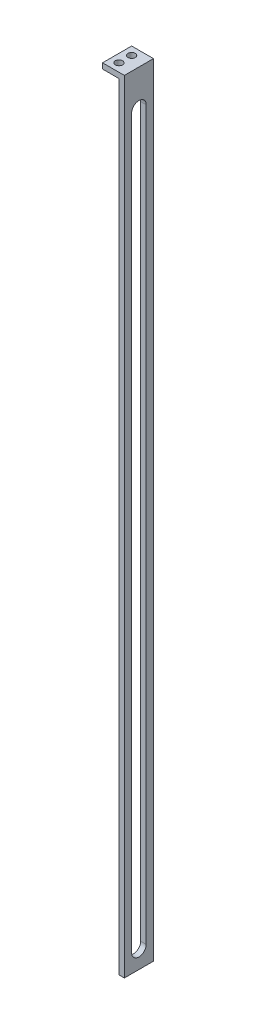
ISO-10303-21;
HEADER;
FILE_DESCRIPTION(('STEP AP214'),'2;1');
FILE_NAME('part.step','',(''),(''),'','','');
FILE_SCHEMA(('AUTOMOTIVE_DESIGN { 1 0 10303 214 1 1 1 1 }'));
ENDSEC;
DATA;
#1=APPLICATION_CONTEXT('core data for automotive mechanical design processes');
#2=APPLICATION_PROTOCOL_DEFINITION('international standard','automotive_design',2000,#1);
#3=PRODUCT_CONTEXT('',#1,'mechanical');
#4=PRODUCT('Part','Part','',(#3));
#5=PRODUCT_RELATED_PRODUCT_CATEGORY('part','',(#4));
#6=PRODUCT_DEFINITION_FORMATION('','',#4);
#7=PRODUCT_DEFINITION_CONTEXT('part definition',#1,'design');
#8=PRODUCT_DEFINITION('design','',#6,#7);
#9=PRODUCT_DEFINITION_SHAPE('','',#8);
#10=(LENGTH_UNIT() NAMED_UNIT(*) SI_UNIT(.MILLI.,.METRE.));
#11=(NAMED_UNIT(*) PLANE_ANGLE_UNIT() SI_UNIT($,.RADIAN.));
#12=(NAMED_UNIT(*) SI_UNIT($,.STERADIAN.) SOLID_ANGLE_UNIT());
#13=UNCERTAINTY_MEASURE_WITH_UNIT(LENGTH_MEASURE(1.E-05),#10,'distance_accuracy_value','');
#14=(GEOMETRIC_REPRESENTATION_CONTEXT(3) GLOBAL_UNCERTAINTY_ASSIGNED_CONTEXT((#13)) GLOBAL_UNIT_ASSIGNED_CONTEXT((#10,
#11,#12)) REPRESENTATION_CONTEXT('',''));
#15=CARTESIAN_POINT('',(0.,0.,0.));
#16=DIRECTION('',(0.,0.,1.));
#17=DIRECTION('',(1.,0.,0.));
#18=AXIS2_PLACEMENT_3D('',#15,#16,#17);
#19=CARTESIAN_POINT('',(-96.6666666666667,106.166666666667,16.));
#20=DIRECTION('',(1.,0.,0.));
#21=DIRECTION('',(0.,0.,-1.));
#22=AXIS2_PLACEMENT_3D('',#19,#20,#21);
#23=PLANE('',#22);
#24=DIRECTION('',(0.,-1.,0.));
#25=VECTOR('',#24,1.);
#26=CARTESIAN_POINT('',(-96.6666666666667,106.166666666667,0.));
#27=LINE('',#26,#25);
#28=CARTESIAN_POINT('',(-96.6666666666667,109.166666666667,0.));
#29=VERTEX_POINT('',#28);
#30=CARTESIAN_POINT('',(-96.6666666666667,106.166666666667,0.));
#31=VERTEX_POINT('',#30);
#32=EDGE_CURVE('E142',#29,#31,#27,.T.);
#33=ORIENTED_EDGE('',*,*,#32,.T.);
#34=DIRECTION('',(0.,0.,-1.));
#35=VECTOR('',#34,1.);
#36=CARTESIAN_POINT('',(-96.6666666666667,106.166666666667,16.));
#37=LINE('',#36,#35);
#38=CARTESIAN_POINT('',(-96.6666666666667,106.166666666667,16.));
#39=VERTEX_POINT('',#38);
#40=EDGE_CURVE('E183',#39,#31,#37,.T.);
#41=ORIENTED_EDGE('',*,*,#40,.F.);
#42=DIRECTION('',(0.,-1.,0.));
#43=VECTOR('',#42,1.);
#44=CARTESIAN_POINT('',(-96.6666666666667,106.166666666667,16.));
#45=LINE('',#44,#43);
#46=CARTESIAN_POINT('',(-96.6666666666667,109.166666666667,16.));
#47=VERTEX_POINT('',#46);
#48=EDGE_CURVE('E143',#47,#39,#45,.T.);
#49=ORIENTED_EDGE('',*,*,#48,.F.);
#50=DIRECTION('',(0.,0.,-1.));
#51=VECTOR('',#50,1.);
#52=CARTESIAN_POINT('',(-96.6666666666667,109.166666666667,16.));
#53=LINE('',#52,#51);
#54=EDGE_CURVE('E157',#47,#29,#53,.T.);
#55=ORIENTED_EDGE('',*,*,#54,.T.);
#56=EDGE_LOOP('',(#33,#41,#49,#55));
#57=FACE_BOUND('',#56,.T.);
#58=ADVANCED_FACE('F34',(#57),#23,.F.);
#59=CARTESIAN_POINT('',(-87.6666666666667,106.166666666667,16.));
#60=DIRECTION('',(0.,1.,0.));
#61=DIRECTION('',(-1.,0.,0.));
#62=AXIS2_PLACEMENT_3D('',#59,#60,#61);
#63=PLANE('',#62);
#64=CARTESIAN_POINT('',(-92.1666666666667,106.166666666667,11.5));
#65=DIRECTION('',(0.,1.,0.));
#66=DIRECTION('',(-1.,0.,0.));
#67=AXIS2_PLACEMENT_3D('',#64,#65,#66);
#68=CIRCLE('',#67,2.);
#69=CARTESIAN_POINT('',(-94.1666666666667,106.166666666667,11.5));
#70=VERTEX_POINT('',#69);
#71=EDGE_CURVE('E139',#70,#70,#68,.T.);
#72=ORIENTED_EDGE('',*,*,#71,.T.);
#73=EDGE_LOOP('',(#72));
#74=FACE_BOUND('',#73,.T.);
#75=CARTESIAN_POINT('',(-92.1666666666667,106.166666666667,4.5));
#76=DIRECTION('',(0.,1.,0.));
#77=DIRECTION('',(-1.,0.,0.));
#78=AXIS2_PLACEMENT_3D('',#75,#76,#77);
#79=CIRCLE('',#78,2.);
#80=CARTESIAN_POINT('',(-94.1666666666667,106.166666666667,4.5));
#81=VERTEX_POINT('',#80);
#82=EDGE_CURVE('E135',#81,#81,#79,.T.);
#83=ORIENTED_EDGE('',*,*,#82,.T.);
#84=EDGE_LOOP('',(#83));
#85=FACE_BOUND('',#84,.T.);
#86=DIRECTION('',(1.,0.,0.));
#87=VECTOR('',#86,1.);
#88=CARTESIAN_POINT('',(-87.6666666666667,106.166666666667,0.));
#89=LINE('',#88,#87);
#90=CARTESIAN_POINT('',(-87.6666666666667,106.166666666667,0.));
#91=VERTEX_POINT('',#90);
#92=EDGE_CURVE('E160',#31,#91,#89,.T.);
#93=ORIENTED_EDGE('',*,*,#92,.T.);
#94=DIRECTION('',(0.,0.,-1.));
#95=VECTOR('',#94,1.);
#96=CARTESIAN_POINT('',(-87.6666666666667,106.166666666667,16.));
#97=LINE('',#96,#95);
#98=CARTESIAN_POINT('',(-87.6666666666667,106.166666666667,16.));
#99=VERTEX_POINT('',#98);
#100=EDGE_CURVE('E180',#99,#91,#97,.T.);
#101=ORIENTED_EDGE('',*,*,#100,.F.);
#102=DIRECTION('',(1.,0.,0.));
#103=VECTOR('',#102,1.);
#104=CARTESIAN_POINT('',(-87.6666666666667,106.166666666667,16.));
#105=LINE('',#104,#103);
#106=EDGE_CURVE('E146',#39,#99,#105,.T.);
#107=ORIENTED_EDGE('',*,*,#106,.F.);
#108=ORIENTED_EDGE('',*,*,#40,.T.);
#109=EDGE_LOOP('',(#93,#101,#107,#108));
#110=FACE_BOUND('',#109,.T.);
#111=ADVANCED_FACE('F213',(#74,#85,#110),#63,.F.);
#112=CARTESIAN_POINT('',(-87.6666666666667,-320.833333333333,16.));
#113=DIRECTION('',(1.,0.,0.));
#114=DIRECTION('',(0.,1.,0.));
#115=AXIS2_PLACEMENT_3D('',#112,#113,#114);
#116=PLANE('',#115);
#117=DIRECTION('',(0.,1.,0.));
#118=VECTOR('',#117,1.);
#119=CARTESIAN_POINT('',(-87.6666666666667,-320.833333333333,3.99999999999995));
#120=LINE('',#119,#118);
#121=CARTESIAN_POINT('',(-87.6666666666667,-310.833333333333,3.99999999999995));
#122=VERTEX_POINT('',#121);
#123=CARTESIAN_POINT('',(-87.6666666666667,89.1666666666667,4.));
#124=VERTEX_POINT('',#123);
#125=EDGE_CURVE('E125',#122,#124,#120,.T.);
#126=ORIENTED_EDGE('',*,*,#125,.T.);
#127=CARTESIAN_POINT('',(-87.6666666666667,89.1666666666667,8.));
#128=DIRECTION('',(1.,0.,0.));
#129=DIRECTION('',(0.,1.,0.));
#130=AXIS2_PLACEMENT_3D('',#127,#128,#129);
#131=CIRCLE('',#130,4.);
#132=CARTESIAN_POINT('',(-87.6666666666667,89.1666666666667,12.));
#133=VERTEX_POINT('',#132);
#134=EDGE_CURVE('E118',#124,#133,#131,.T.);
#135=ORIENTED_EDGE('',*,*,#134,.T.);
#136=DIRECTION('',(0.,-1.,0.));
#137=VECTOR('',#136,1.);
#138=CARTESIAN_POINT('',(-87.6666666666667,-320.833333333333,12.));
#139=LINE('',#138,#137);
#140=CARTESIAN_POINT('',(-87.6666666666667,-310.833333333333,12.));
#141=VERTEX_POINT('',#140);
#142=EDGE_CURVE('E107',#133,#141,#139,.T.);
#143=ORIENTED_EDGE('',*,*,#142,.T.);
#144=CARTESIAN_POINT('',(-87.6666666666667,-310.833333333333,7.99999999999995));
#145=DIRECTION('',(1.,0.,0.));
#146=DIRECTION('',(0.,1.,0.));
#147=AXIS2_PLACEMENT_3D('',#144,#145,#146);
#148=CIRCLE('',#147,4.);
#149=EDGE_CURVE('E112',#141,#122,#148,.T.);
#150=ORIENTED_EDGE('',*,*,#149,.T.);
#151=EDGE_LOOP('',(#126,#135,#143,#150));
#152=FACE_BOUND('',#151,.T.);
#153=DIRECTION('',(0.,-1.,0.));
#154=VECTOR('',#153,1.);
#155=CARTESIAN_POINT('',(-87.6666666666667,-320.833333333333,0.));
#156=LINE('',#155,#154);
#157=CARTESIAN_POINT('',(-87.6666666666667,-320.833333333333,0.));
#158=VERTEX_POINT('',#157);
#159=EDGE_CURVE('E162',#91,#158,#156,.T.);
#160=ORIENTED_EDGE('',*,*,#159,.T.);
#161=DIRECTION('',(0.,0.,-1.));
#162=VECTOR('',#161,1.);
#163=CARTESIAN_POINT('',(-87.6666666666667,-320.833333333333,16.));
#164=LINE('',#163,#162);
#165=CARTESIAN_POINT('',(-87.6666666666667,-320.833333333333,16.));
#166=VERTEX_POINT('',#165);
#167=EDGE_CURVE('E177',#166,#158,#164,.T.);
#168=ORIENTED_EDGE('',*,*,#167,.F.);
#169=DIRECTION('',(0.,-1.,0.));
#170=VECTOR('',#169,1.);
#171=CARTESIAN_POINT('',(-87.6666666666667,-320.833333333333,16.));
#172=LINE('',#171,#170);
#173=EDGE_CURVE('E149',#99,#166,#172,.T.);
#174=ORIENTED_EDGE('',*,*,#173,.F.);
#175=ORIENTED_EDGE('',*,*,#100,.T.);
#176=EDGE_LOOP('',(#160,#168,#174,#175));
#177=FACE_BOUND('',#176,.T.);
#178=ADVANCED_FACE('F123',(#152,#177),#116,.F.);
#179=CARTESIAN_POINT('',(-84.6666666666666,-320.833333333333,16.));
#180=DIRECTION('',(0.,1.,0.));
#181=DIRECTION('',(0.,0.,1.));
#182=AXIS2_PLACEMENT_3D('',#179,#180,#181);
#183=PLANE('',#182);
#184=DIRECTION('',(1.,0.,0.));
#185=VECTOR('',#184,1.);
#186=CARTESIAN_POINT('',(-84.6666666666666,-320.833333333333,0.));
#187=LINE('',#186,#185);
#188=CARTESIAN_POINT('',(-84.6666666666666,-320.833333333333,0.));
#189=VERTEX_POINT('',#188);
#190=EDGE_CURVE('E164',#158,#189,#187,.T.);
#191=ORIENTED_EDGE('',*,*,#190,.T.);
#192=DIRECTION('',(0.,0.,-1.));
#193=VECTOR('',#192,1.);
#194=CARTESIAN_POINT('',(-84.6666666666666,-320.833333333333,16.));
#195=LINE('',#194,#193);
#196=CARTESIAN_POINT('',(-84.6666666666666,-320.833333333333,16.));
#197=VERTEX_POINT('',#196);
#198=EDGE_CURVE('E174',#197,#189,#195,.T.);
#199=ORIENTED_EDGE('',*,*,#198,.F.);
#200=DIRECTION('',(1.,0.,0.));
#201=VECTOR('',#200,1.);
#202=CARTESIAN_POINT('',(-84.6666666666666,-320.833333333333,16.));
#203=LINE('',#202,#201);
#204=EDGE_CURVE('E151',#166,#197,#203,.T.);
#205=ORIENTED_EDGE('',*,*,#204,.F.);
#206=ORIENTED_EDGE('',*,*,#167,.T.);
#207=EDGE_LOOP('',(#191,#199,#205,#206));
#208=FACE_BOUND('',#207,.T.);
#209=ADVANCED_FACE('F241',(#208),#183,.F.);
#210=CARTESIAN_POINT('',(-84.6666666666667,109.166666666667,16.));
#211=DIRECTION('',(-1.,0.,0.));
#212=DIRECTION('',(0.,-1.,0.));
#213=AXIS2_PLACEMENT_3D('',#210,#211,#212);
#214=PLANE('',#213);
#215=DIRECTION('',(0.,1.,0.));
#216=VECTOR('',#215,1.);
#217=CARTESIAN_POINT('',(-84.6666666666667,109.166666666667,12.));
#218=LINE('',#217,#216);
#219=CARTESIAN_POINT('',(-84.6666666666667,-310.833333333333,12.));
#220=VERTEX_POINT('',#219);
#221=CARTESIAN_POINT('',(-84.6666666666667,89.1666666666667,12.));
#222=VERTEX_POINT('',#221);
#223=EDGE_CURVE('E186',#220,#222,#218,.T.);
#224=ORIENTED_EDGE('',*,*,#223,.T.);
#225=CARTESIAN_POINT('',(-84.6666666666667,89.1666666666667,8.));
#226=DIRECTION('',(-1.,0.,0.));
#227=DIRECTION('',(0.,-1.,0.));
#228=AXIS2_PLACEMENT_3D('',#225,#226,#227);
#229=CIRCLE('',#228,4.);
#230=CARTESIAN_POINT('',(-84.6666666666667,89.1666666666667,4.));
#231=VERTEX_POINT('',#230);
#232=EDGE_CURVE('E11',#222,#231,#229,.T.);
#233=ORIENTED_EDGE('',*,*,#232,.T.);
#234=DIRECTION('',(0.,-1.,0.));
#235=VECTOR('',#234,1.);
#236=CARTESIAN_POINT('',(-84.6666666666667,109.166666666667,4.));
#237=LINE('',#236,#235);
#238=CARTESIAN_POINT('',(-84.6666666666666,-310.833333333333,3.99999999999995));
#239=VERTEX_POINT('',#238);
#240=EDGE_CURVE('E41',#231,#239,#237,.T.);
#241=ORIENTED_EDGE('',*,*,#240,.T.);
#242=CARTESIAN_POINT('',(-84.6666666666666,-310.833333333333,7.99999999999995));
#243=DIRECTION('',(-1.,0.,0.));
#244=DIRECTION('',(0.,-1.,0.));
#245=AXIS2_PLACEMENT_3D('',#242,#243,#244);
#246=CIRCLE('',#245,4.);
#247=EDGE_CURVE('E188',#239,#220,#246,.T.);
#248=ORIENTED_EDGE('',*,*,#247,.T.);
#249=EDGE_LOOP('',(#224,#233,#241,#248));
#250=FACE_BOUND('',#249,.T.);
#251=DIRECTION('',(0.,1.,0.));
#252=VECTOR('',#251,1.);
#253=CARTESIAN_POINT('',(-84.6666666666667,109.166666666667,0.));
#254=LINE('',#253,#252);
#255=CARTESIAN_POINT('',(-84.6666666666667,109.166666666667,0.));
#256=VERTEX_POINT('',#255);
#257=EDGE_CURVE('E166',#189,#256,#254,.T.);
#258=ORIENTED_EDGE('',*,*,#257,.T.);
#259=DIRECTION('',(0.,0.,-1.));
#260=VECTOR('',#259,1.);
#261=CARTESIAN_POINT('',(-84.6666666666667,109.166666666667,16.));
#262=LINE('',#261,#260);
#263=CARTESIAN_POINT('',(-84.6666666666667,109.166666666667,16.));
#264=VERTEX_POINT('',#263);
#265=EDGE_CURVE('E171',#264,#256,#262,.T.);
#266=ORIENTED_EDGE('',*,*,#265,.F.);
#267=DIRECTION('',(0.,1.,0.));
#268=VECTOR('',#267,1.);
#269=CARTESIAN_POINT('',(-84.6666666666667,109.166666666667,16.));
#270=LINE('',#269,#268);
#271=EDGE_CURVE('E153',#197,#264,#270,.T.);
#272=ORIENTED_EDGE('',*,*,#271,.F.);
#273=ORIENTED_EDGE('',*,*,#198,.T.);
#274=EDGE_LOOP('',(#258,#266,#272,#273));
#275=FACE_BOUND('',#274,.T.);
#276=ADVANCED_FACE('F192',(#250,#275),#214,.F.);
#277=CARTESIAN_POINT('',(-96.6666666666667,109.166666666667,16.));
#278=DIRECTION('',(0.,-1.,0.));
#279=DIRECTION('',(0.,0.,-1.));
#280=AXIS2_PLACEMENT_3D('',#277,#278,#279);
#281=PLANE('',#280);
#282=CARTESIAN_POINT('',(-92.1666666666667,109.166666666667,11.5));
#283=DIRECTION('',(0.,1.,0.));
#284=DIRECTION('',(0.,0.,1.));
#285=AXIS2_PLACEMENT_3D('',#282,#283,#284);
#286=CIRCLE('',#285,2.);
#287=CARTESIAN_POINT('',(-92.1666666666667,109.166666666667,13.5));
#288=VERTEX_POINT('',#287);
#289=EDGE_CURVE('E129',#288,#288,#286,.T.);
#290=ORIENTED_EDGE('',*,*,#289,.F.);
#291=EDGE_LOOP('',(#290));
#292=FACE_BOUND('',#291,.T.);
#293=CARTESIAN_POINT('',(-92.1666666666667,109.166666666667,4.5));
#294=DIRECTION('',(0.,1.,0.));
#295=DIRECTION('',(0.,0.,-1.));
#296=AXIS2_PLACEMENT_3D('',#293,#294,#295);
#297=CIRCLE('',#296,2.);
#298=CARTESIAN_POINT('',(-92.1666666666667,109.166666666667,2.50000000000001));
#299=VERTEX_POINT('',#298);
#300=EDGE_CURVE('E126',#299,#299,#297,.T.);
#301=ORIENTED_EDGE('',*,*,#300,.F.);
#302=EDGE_LOOP('',(#301));
#303=FACE_BOUND('',#302,.T.);
#304=DIRECTION('',(-1.,0.,0.));
#305=VECTOR('',#304,1.);
#306=CARTESIAN_POINT('',(-96.6666666666667,109.166666666667,0.));
#307=LINE('',#306,#305);
#308=EDGE_CURVE('E147',#256,#29,#307,.T.);
#309=ORIENTED_EDGE('',*,*,#308,.T.);
#310=ORIENTED_EDGE('',*,*,#54,.F.);
#311=DIRECTION('',(-1.,0.,0.));
#312=VECTOR('',#311,1.);
#313=CARTESIAN_POINT('',(-96.6666666666667,109.166666666667,16.));
#314=LINE('',#313,#312);
#315=EDGE_CURVE('E155',#264,#47,#314,.T.);
#316=ORIENTED_EDGE('',*,*,#315,.F.);
#317=ORIENTED_EDGE('',*,*,#265,.T.);
#318=EDGE_LOOP('',(#309,#310,#316,#317));
#319=FACE_BOUND('',#318,.T.);
#320=ADVANCED_FACE('F238',(#292,#303,#319),#281,.F.);
#321=CARTESIAN_POINT('',(0.,0.,16.));
#322=DIRECTION('',(0.,0.,-1.));
#323=DIRECTION('',(-1.,0.,0.));
#324=AXIS2_PLACEMENT_3D('',#321,#322,#323);
#325=PLANE('',#324);
#326=ORIENTED_EDGE('',*,*,#48,.T.);
#327=ORIENTED_EDGE('',*,*,#106,.T.);
#328=ORIENTED_EDGE('',*,*,#173,.T.);
#329=ORIENTED_EDGE('',*,*,#204,.T.);
#330=ORIENTED_EDGE('',*,*,#271,.T.);
#331=ORIENTED_EDGE('',*,*,#315,.T.);
#332=EDGE_LOOP('',(#326,#327,#328,#329,#330,#331));
#333=FACE_BOUND('',#332,.T.);
#334=ADVANCED_FACE('F233',(#333),#325,.F.);
#335=CARTESIAN_POINT('',(0.,0.,0.));
#336=DIRECTION('',(0.,0.,-1.));
#337=DIRECTION('',(-1.,0.,0.));
#338=AXIS2_PLACEMENT_3D('',#335,#336,#337);
#339=PLANE('',#338);
#340=ORIENTED_EDGE('',*,*,#32,.F.);
#341=ORIENTED_EDGE('',*,*,#308,.F.);
#342=ORIENTED_EDGE('',*,*,#257,.F.);
#343=ORIENTED_EDGE('',*,*,#190,.F.);
#344=ORIENTED_EDGE('',*,*,#159,.F.);
#345=ORIENTED_EDGE('',*,*,#92,.F.);
#346=EDGE_LOOP('',(#340,#341,#342,#343,#344,#345));
#347=FACE_BOUND('',#346,.T.);
#348=ADVANCED_FACE('F225',(#347),#339,.T.);
#349=CARTESIAN_POINT('',(-92.1666666666667,-320.833333333333,4.5));
#350=DIRECTION('',(0.,1.,0.));
#351=DIRECTION('',(0.,0.,1.));
#352=AXIS2_PLACEMENT_3D('',#349,#350,#351);
#353=CYLINDRICAL_SURFACE('',#352,2.);
#354=ORIENTED_EDGE('',*,*,#300,.T.);
#355=EDGE_LOOP('',(#354));
#356=FACE_BOUND('',#355,.T.);
#357=ORIENTED_EDGE('',*,*,#82,.F.);
#358=EDGE_LOOP('',(#357));
#359=FACE_BOUND('',#358,.T.);
#360=ADVANCED_FACE('F258',(#356,#359),#353,.F.);
#361=CARTESIAN_POINT('',(-92.1666666666667,-320.833333333333,11.5));
#362=DIRECTION('',(0.,1.,0.));
#363=DIRECTION('',(0.,0.,1.));
#364=AXIS2_PLACEMENT_3D('',#361,#362,#363);
#365=CYLINDRICAL_SURFACE('',#364,2.);
#366=ORIENTED_EDGE('',*,*,#289,.T.);
#367=EDGE_LOOP('',(#366));
#368=FACE_BOUND('',#367,.T.);
#369=ORIENTED_EDGE('',*,*,#71,.F.);
#370=EDGE_LOOP('',(#369));
#371=FACE_BOUND('',#370,.T.);
#372=ADVANCED_FACE('F263',(#368,#371),#365,.F.);
#373=CARTESIAN_POINT('',(-96.6666666666667,89.1666666666667,8.));
#374=DIRECTION('',(1.,0.,0.));
#375=DIRECTION('',(0.,0.,-1.));
#376=AXIS2_PLACEMENT_3D('',#373,#374,#375);
#377=CYLINDRICAL_SURFACE('',#376,4.);
#378=DIRECTION('',(1.,0.,0.));
#379=VECTOR('',#378,1.);
#380=CARTESIAN_POINT('',(-96.6666666666667,89.1666666666667,4.));
#381=LINE('',#380,#379);
#382=EDGE_CURVE('E113',#124,#231,#381,.T.);
#383=ORIENTED_EDGE('',*,*,#382,.T.);
#384=ORIENTED_EDGE('',*,*,#232,.F.);
#385=DIRECTION('',(1.,0.,0.));
#386=VECTOR('',#385,1.);
#387=CARTESIAN_POINT('',(-96.6666666666667,89.1666666666667,12.));
#388=LINE('',#387,#386);
#389=EDGE_CURVE('E53',#133,#222,#388,.T.);
#390=ORIENTED_EDGE('',*,*,#389,.F.);
#391=ORIENTED_EDGE('',*,*,#134,.F.);
#392=EDGE_LOOP('',(#383,#384,#390,#391));
#393=FACE_BOUND('',#392,.T.);
#394=ADVANCED_FACE('F117',(#393),#377,.F.);
#395=CARTESIAN_POINT('',(-96.6666666666667,89.1666666666667,4.));
#396=DIRECTION('',(0.,0.,-1.));
#397=DIRECTION('',(0.,1.,0.));
#398=AXIS2_PLACEMENT_3D('',#395,#396,#397);
#399=PLANE('',#398);
#400=DIRECTION('',(1.,0.,0.));
#401=VECTOR('',#400,1.);
#402=CARTESIAN_POINT('',(-96.6666666666667,-310.833333333333,3.99999999999995));
#403=LINE('',#402,#401);
#404=EDGE_CURVE('E198',#122,#239,#403,.T.);
#405=ORIENTED_EDGE('',*,*,#404,.T.);
#406=ORIENTED_EDGE('',*,*,#240,.F.);
#407=ORIENTED_EDGE('',*,*,#382,.F.);
#408=ORIENTED_EDGE('',*,*,#125,.F.);
#409=EDGE_LOOP('',(#405,#406,#407,#408));
#410=FACE_BOUND('',#409,.T.);
#411=ADVANCED_FACE('F196',(#410),#399,.F.);
#412=CARTESIAN_POINT('',(-96.6666666666667,-310.833333333333,7.99999999999995));
#413=DIRECTION('',(1.,0.,0.));
#414=DIRECTION('',(0.,0.,-1.));
#415=AXIS2_PLACEMENT_3D('',#412,#413,#414);
#416=CYLINDRICAL_SURFACE('',#415,4.);
#417=DIRECTION('',(1.,0.,0.));
#418=VECTOR('',#417,1.);
#419=CARTESIAN_POINT('',(-96.6666666666667,-310.833333333333,12.));
#420=LINE('',#419,#418);
#421=EDGE_CURVE('E48',#141,#220,#420,.T.);
#422=ORIENTED_EDGE('',*,*,#421,.T.);
#423=ORIENTED_EDGE('',*,*,#247,.F.);
#424=ORIENTED_EDGE('',*,*,#404,.F.);
#425=ORIENTED_EDGE('',*,*,#149,.F.);
#426=EDGE_LOOP('',(#422,#423,#424,#425));
#427=FACE_BOUND('',#426,.T.);
#428=ADVANCED_FACE('F203',(#427),#416,.F.);
#429=CARTESIAN_POINT('',(-96.6666666666667,89.1666666666667,12.));
#430=DIRECTION('',(0.,0.,1.));
#431=DIRECTION('',(0.,-1.,0.));
#432=AXIS2_PLACEMENT_3D('',#429,#430,#431);
#433=PLANE('',#432);
#434=ORIENTED_EDGE('',*,*,#389,.T.);
#435=ORIENTED_EDGE('',*,*,#223,.F.);
#436=ORIENTED_EDGE('',*,*,#421,.F.);
#437=ORIENTED_EDGE('',*,*,#142,.F.);
#438=EDGE_LOOP('',(#434,#435,#436,#437));
#439=FACE_BOUND('',#438,.T.);
#440=ADVANCED_FACE('F108',(#439),#433,.F.);
#441=CLOSED_SHELL('',(#58,#111,#178,#209,#276,#320,#334,#348,#360,#372,#394,#411,#428,#440));
#442=MANIFOLD_SOLID_BREP('B2',#441);
#443=ADVANCED_BREP_SHAPE_REPRESENTATION('',(#18,#442),#14);
#444=SHAPE_DEFINITION_REPRESENTATION(#9,#443);
ENDSEC;
END-ISO-10303-21;
